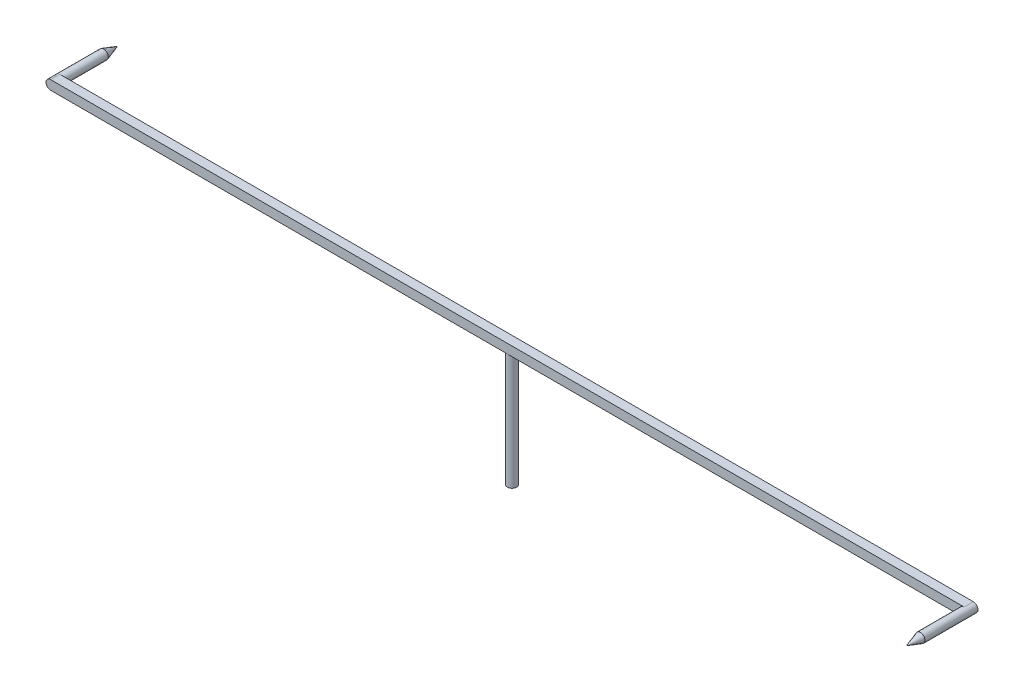
ISO-10303-21;
HEADER;
FILE_DESCRIPTION(('STEP AP214'),'2;1');
FILE_NAME('part.step','',(''),(''),'','','');
FILE_SCHEMA(('AUTOMOTIVE_DESIGN { 1 0 10303 214 1 1 1 1 }'));
ENDSEC;
DATA;
#1=APPLICATION_CONTEXT('core data for automotive mechanical design processes');
#2=APPLICATION_PROTOCOL_DEFINITION('international standard','automotive_design',2000,#1);
#3=PRODUCT_CONTEXT('',#1,'mechanical');
#4=PRODUCT('Part','Part','',(#3));
#5=PRODUCT_RELATED_PRODUCT_CATEGORY('part','',(#4));
#6=PRODUCT_DEFINITION_FORMATION('','',#4);
#7=PRODUCT_DEFINITION_CONTEXT('part definition',#1,'design');
#8=PRODUCT_DEFINITION('design','',#6,#7);
#9=PRODUCT_DEFINITION_SHAPE('','',#8);
#10=(LENGTH_UNIT() NAMED_UNIT(*) SI_UNIT(.MILLI.,.METRE.));
#11=(NAMED_UNIT(*) PLANE_ANGLE_UNIT() SI_UNIT($,.RADIAN.));
#12=(NAMED_UNIT(*) SI_UNIT($,.STERADIAN.) SOLID_ANGLE_UNIT());
#13=UNCERTAINTY_MEASURE_WITH_UNIT(LENGTH_MEASURE(1.E-05),#10,'distance_accuracy_value','');
#14=(GEOMETRIC_REPRESENTATION_CONTEXT(3) GLOBAL_UNCERTAINTY_ASSIGNED_CONTEXT((#13)) GLOBAL_UNIT_ASSIGNED_CONTEXT((#10,
#11,#12)) REPRESENTATION_CONTEXT('',''));
#15=CARTESIAN_POINT('',(0.,0.,0.));
#16=DIRECTION('',(0.,0.,1.));
#17=DIRECTION('',(1.,0.,0.));
#18=AXIS2_PLACEMENT_3D('',#15,#16,#17);
#19=CARTESIAN_POINT('',(0.,10.,0.));
#20=DIRECTION('',(0.,-1.,0.));
#21=DIRECTION('',(0.,0.,-1.));
#22=AXIS2_PLACEMENT_3D('',#19,#20,#21);
#23=CYLINDRICAL_SURFACE('',#22,0.4);
#24=CARTESIAN_POINT('',(0.,10.,0.));
#25=DIRECTION('',(0.,1.,0.));
#26=DIRECTION('',(0.,0.,1.));
#27=AXIS2_PLACEMENT_3D('',#24,#25,#26);
#28=CIRCLE('',#27,0.4);
#29=CARTESIAN_POINT('',(0.,10.,0.4));
#30=VERTEX_POINT('',#29);
#31=CARTESIAN_POINT('',(0.,10.,-0.4));
#32=VERTEX_POINT('',#31);
#33=EDGE_CURVE('E164',#30,#32,#28,.T.);
#34=ORIENTED_EDGE('',*,*,#33,.F.);
#35=EDGE_CURVE('E168',#32,#30,#28,.T.);
#36=ORIENTED_EDGE('',*,*,#35,.F.);
#37=EDGE_LOOP('',(#34,#36));
#38=FACE_BOUND('',#37,.T.);
#39=CARTESIAN_POINT('',(0.,0.,0.));
#40=DIRECTION('',(0.,1.,0.));
#41=DIRECTION('',(0.,0.,1.));
#42=AXIS2_PLACEMENT_3D('',#39,#40,#41);
#43=CIRCLE('',#42,0.4);
#44=CARTESIAN_POINT('',(0.,0.,0.4));
#45=VERTEX_POINT('',#44);
#46=EDGE_CURVE('E158',#45,#45,#43,.T.);
#47=ORIENTED_EDGE('',*,*,#46,.T.);
#48=EDGE_LOOP('',(#47));
#49=FACE_BOUND('',#48,.T.);
#50=ADVANCED_FACE('F37',(#38,#49),#23,.T.);
#51=CARTESIAN_POINT('',(0.,0.,0.));
#52=DIRECTION('',(0.,1.,0.));
#53=DIRECTION('',(0.,0.,1.));
#54=AXIS2_PLACEMENT_3D('',#51,#52,#53);
#55=PLANE('',#54);
#56=ORIENTED_EDGE('',*,*,#46,.F.);
#57=EDGE_LOOP('',(#56));
#58=FACE_BOUND('',#57,.T.);
#59=ADVANCED_FACE('F114',(#58),#55,.F.);
#60=CARTESIAN_POINT('',(0.,10.,0.));
#61=DIRECTION('',(0.,1.,0.));
#62=DIRECTION('',(0.,0.,1.));
#63=AXIS2_PLACEMENT_3D('',#60,#61,#62);
#64=PLANE('',#63);
#65=DIRECTION('',(-1.,0.,0.));
#66=VECTOR('',#65,1.);
#67=CARTESIAN_POINT('',(-40.,10.,-0.4));
#68=LINE('',#67,#66);
#69=CARTESIAN_POINT('',(39.6,10.,-0.4));
#70=VERTEX_POINT('',#69);
#71=EDGE_CURVE('E156',#70,#32,#68,.T.);
#72=ORIENTED_EDGE('',*,*,#71,.F.);
#73=DIRECTION('',(0.,0.,-1.));
#74=VECTOR('',#73,1.);
#75=CARTESIAN_POINT('',(39.6,10.,0.));
#76=LINE('',#75,#74);
#77=CARTESIAN_POINT('',(39.6,10.,0.4));
#78=VERTEX_POINT('',#77);
#79=EDGE_CURVE('E11',#70,#78,#76,.F.);
#80=ORIENTED_EDGE('',*,*,#79,.T.);
#81=DIRECTION('',(1.,0.,0.));
#82=VECTOR('',#81,1.);
#83=CARTESIAN_POINT('',(-40.,10.,0.4));
#84=LINE('',#83,#82);
#85=EDGE_CURVE('E162',#30,#78,#84,.T.);
#86=ORIENTED_EDGE('',*,*,#85,.F.);
#87=ORIENTED_EDGE('',*,*,#33,.T.);
#88=EDGE_LOOP('',(#72,#80,#86,#87));
#89=FACE_BOUND('',#88,.T.);
#90=ADVANCED_FACE('F120',(#89),#64,.F.);
#91=CARTESIAN_POINT('',(-39.6,10.,0.4));
#92=VERTEX_POINT('',#91);
#93=EDGE_CURVE('E159',#92,#30,#84,.T.);
#94=ORIENTED_EDGE('',*,*,#93,.F.);
#95=DIRECTION('',(0.,0.,1.));
#96=VECTOR('',#95,1.);
#97=CARTESIAN_POINT('',(-39.6,10.,0.));
#98=LINE('',#97,#96);
#99=CARTESIAN_POINT('',(-39.6,10.,-0.4));
#100=VERTEX_POINT('',#99);
#101=EDGE_CURVE('E174',#92,#100,#98,.F.);
#102=ORIENTED_EDGE('',*,*,#101,.T.);
#103=EDGE_CURVE('E161',#32,#100,#68,.T.);
#104=ORIENTED_EDGE('',*,*,#103,.F.);
#105=ORIENTED_EDGE('',*,*,#35,.T.);
#106=EDGE_LOOP('',(#94,#102,#104,#105));
#107=FACE_BOUND('',#106,.T.);
#108=ADVANCED_FACE('F197',(#107),#64,.F.);
#109=CARTESIAN_POINT('',(-40.,10.8,0.4));
#110=DIRECTION('',(0.,0.,-1.));
#111=DIRECTION('',(-1.,0.,0.));
#112=AXIS2_PLACEMENT_3D('',#109,#110,#111);
#113=PLANE('',#112);
#114=CARTESIAN_POINT('',(39.6,10.4,0.4));
#115=DIRECTION('',(0.,0.,1.));
#116=DIRECTION('',(1.,0.,0.));
#117=AXIS2_PLACEMENT_3D('',#114,#115,#116);
#118=CIRCLE('',#117,0.399999999999998);
#119=CARTESIAN_POINT('',(39.6,10.8,0.4));
#120=VERTEX_POINT('',#119);
#121=EDGE_CURVE('E143',#120,#78,#118,.T.);
#122=ORIENTED_EDGE('',*,*,#121,.F.);
#123=DIRECTION('',(1.,0.,0.));
#124=VECTOR('',#123,1.);
#125=CARTESIAN_POINT('',(-40.,10.8,0.4));
#126=LINE('',#125,#124);
#127=CARTESIAN_POINT('',(-39.6,10.8,0.4));
#128=VERTEX_POINT('',#127);
#129=EDGE_CURVE('E152',#128,#120,#126,.T.);
#130=ORIENTED_EDGE('',*,*,#129,.F.);
#131=CARTESIAN_POINT('',(-39.6,10.4,0.4));
#132=DIRECTION('',(0.,0.,-1.));
#133=DIRECTION('',(-1.,0.,0.));
#134=AXIS2_PLACEMENT_3D('',#131,#132,#133);
#135=CIRCLE('',#134,0.4);
#136=CARTESIAN_POINT('',(-40.,10.4,0.4));
#137=VERTEX_POINT('',#136);
#138=EDGE_CURVE('E167',#128,#137,#135,.F.);
#139=ORIENTED_EDGE('',*,*,#138,.T.);
#140=CARTESIAN_POINT('',(-39.6,10.4,0.4));
#141=DIRECTION('',(0.,0.,-1.));
#142=DIRECTION('',(-1.,0.,0.));
#143=AXIS2_PLACEMENT_3D('',#140,#141,#142);
#144=CIRCLE('',#143,0.4);
#145=EDGE_CURVE('E172',#137,#92,#144,.F.);
#146=ORIENTED_EDGE('',*,*,#145,.T.);
#147=ORIENTED_EDGE('',*,*,#93,.T.);
#148=ORIENTED_EDGE('',*,*,#85,.T.);
#149=EDGE_LOOP('',(#122,#130,#139,#146,#147,#148));
#150=FACE_BOUND('',#149,.T.);
#151=ADVANCED_FACE('F200',(#150),#113,.F.);
#152=CARTESIAN_POINT('',(-40.,10.8,-0.4));
#153=DIRECTION('',(0.,0.,1.));
#154=DIRECTION('',(1.,0.,0.));
#155=AXIS2_PLACEMENT_3D('',#152,#153,#154);
#156=PLANE('',#155);
#157=CARTESIAN_POINT('',(-39.6,10.4,-0.4));
#158=DIRECTION('',(0.,0.,-1.));
#159=DIRECTION('',(-1.,0.,0.));
#160=AXIS2_PLACEMENT_3D('',#157,#158,#159);
#161=CIRCLE('',#160,0.399999999999998);
#162=CARTESIAN_POINT('',(-39.6,10.8,-0.4));
#163=VERTEX_POINT('',#162);
#164=EDGE_CURVE('E60',#163,#100,#161,.T.);
#165=ORIENTED_EDGE('',*,*,#164,.F.);
#166=DIRECTION('',(-1.,0.,0.));
#167=VECTOR('',#166,1.);
#168=CARTESIAN_POINT('',(-40.,10.8,-0.4));
#169=LINE('',#168,#167);
#170=CARTESIAN_POINT('',(39.6,10.8,-0.4));
#171=VERTEX_POINT('',#170);
#172=EDGE_CURVE('E155',#171,#163,#169,.T.);
#173=ORIENTED_EDGE('',*,*,#172,.F.);
#174=CARTESIAN_POINT('',(39.6,10.4,-0.4));
#175=DIRECTION('',(0.,0.,1.));
#176=DIRECTION('',(1.,0.,0.));
#177=AXIS2_PLACEMENT_3D('',#174,#175,#176);
#178=CIRCLE('',#177,0.4);
#179=CARTESIAN_POINT('',(40.,10.4,-0.4));
#180=VERTEX_POINT('',#179);
#181=EDGE_CURVE('E54',#171,#180,#178,.F.);
#182=ORIENTED_EDGE('',*,*,#181,.T.);
#183=CARTESIAN_POINT('',(39.6,10.4,-0.4));
#184=DIRECTION('',(0.,0.,1.));
#185=DIRECTION('',(1.,0.,0.));
#186=AXIS2_PLACEMENT_3D('',#183,#184,#185);
#187=CIRCLE('',#186,0.4);
#188=EDGE_CURVE('E177',#180,#70,#187,.F.);
#189=ORIENTED_EDGE('',*,*,#188,.T.);
#190=ORIENTED_EDGE('',*,*,#71,.T.);
#191=ORIENTED_EDGE('',*,*,#103,.T.);
#192=EDGE_LOOP('',(#165,#173,#182,#189,#190,#191));
#193=FACE_BOUND('',#192,.T.);
#194=ADVANCED_FACE('F135',(#193),#156,.F.);
#195=CARTESIAN_POINT('',(0.,10.8,0.));
#196=DIRECTION('',(0.,1.,0.));
#197=DIRECTION('',(0.,0.,1.));
#198=AXIS2_PLACEMENT_3D('',#195,#196,#197);
#199=PLANE('',#198);
#200=ORIENTED_EDGE('',*,*,#172,.T.);
#201=DIRECTION('',(0.,0.,1.));
#202=VECTOR('',#201,1.);
#203=CARTESIAN_POINT('',(-39.6,10.8,0.4));
#204=LINE('',#203,#202);
#205=EDGE_CURVE('E46',#163,#128,#204,.T.);
#206=ORIENTED_EDGE('',*,*,#205,.T.);
#207=ORIENTED_EDGE('',*,*,#129,.T.);
#208=DIRECTION('',(0.,0.,-1.));
#209=VECTOR('',#208,1.);
#210=CARTESIAN_POINT('',(39.6,10.8,-0.4));
#211=LINE('',#210,#209);
#212=EDGE_CURVE('E179',#120,#171,#211,.T.);
#213=ORIENTED_EDGE('',*,*,#212,.T.);
#214=EDGE_LOOP('',(#200,#206,#207,#213));
#215=FACE_BOUND('',#214,.T.);
#216=ADVANCED_FACE('F128',(#215),#199,.T.);
#217=CARTESIAN_POINT('',(-39.6,10.4,0.));
#218=DIRECTION('',(0.,0.,-1.));
#219=DIRECTION('',(-1.,0.,0.));
#220=AXIS2_PLACEMENT_3D('',#217,#218,#219);
#221=CYLINDRICAL_SURFACE('',#220,0.4);
#222=ORIENTED_EDGE('',*,*,#205,.F.);
#223=ORIENTED_EDGE('',*,*,#164,.T.);
#224=ORIENTED_EDGE('',*,*,#101,.F.);
#225=ORIENTED_EDGE('',*,*,#145,.F.);
#226=DIRECTION('',(0.,0.,1.));
#227=VECTOR('',#226,1.);
#228=CARTESIAN_POINT('',(-40.,10.4,-0.4));
#229=LINE('',#228,#227);
#230=CARTESIAN_POINT('',(-40.,10.4,-0.4));
#231=VERTEX_POINT('',#230);
#232=EDGE_CURVE('E181',#137,#231,#229,.F.);
#233=ORIENTED_EDGE('',*,*,#232,.T.);
#234=ORIENTED_EDGE('',*,*,#232,.F.);
#235=ORIENTED_EDGE('',*,*,#138,.F.);
#236=EDGE_LOOP('',(#222,#223,#224,#225,#233,#234,#235));
#237=FACE_BOUND('',#236,.T.);
#238=CARTESIAN_POINT('',(-39.6,10.4,-4.2));
#239=DIRECTION('',(0.,0.,-1.));
#240=DIRECTION('',(-1.,0.,0.));
#241=AXIS2_PLACEMENT_3D('',#238,#239,#240);
#242=CIRCLE('',#241,0.399999999999998);
#243=CARTESIAN_POINT('',(-40.,10.4,-4.2));
#244=VERTEX_POINT('',#243);
#245=EDGE_CURVE('E142',#244,#244,#242,.T.);
#246=ORIENTED_EDGE('',*,*,#245,.F.);
#247=EDGE_LOOP('',(#246));
#248=FACE_BOUND('',#247,.T.);
#249=ADVANCED_FACE('F126',(#237,#248),#221,.T.);
#250=CARTESIAN_POINT('',(39.6,10.4,0.));
#251=DIRECTION('',(0.,0.,1.));
#252=DIRECTION('',(1.,0.,0.));
#253=AXIS2_PLACEMENT_3D('',#250,#251,#252);
#254=CYLINDRICAL_SURFACE('',#253,0.4);
#255=ORIENTED_EDGE('',*,*,#212,.F.);
#256=ORIENTED_EDGE('',*,*,#121,.T.);
#257=ORIENTED_EDGE('',*,*,#79,.F.);
#258=ORIENTED_EDGE('',*,*,#188,.F.);
#259=DIRECTION('',(0.,0.,-1.));
#260=VECTOR('',#259,1.);
#261=CARTESIAN_POINT('',(40.,10.4,0.4));
#262=LINE('',#261,#260);
#263=CARTESIAN_POINT('',(40.,10.4,0.4));
#264=VERTEX_POINT('',#263);
#265=EDGE_CURVE('E41',#180,#264,#262,.F.);
#266=ORIENTED_EDGE('',*,*,#265,.T.);
#267=ORIENTED_EDGE('',*,*,#265,.F.);
#268=ORIENTED_EDGE('',*,*,#181,.F.);
#269=EDGE_LOOP('',(#255,#256,#257,#258,#266,#267,#268));
#270=FACE_BOUND('',#269,.T.);
#271=CARTESIAN_POINT('',(39.6,10.4,4.2));
#272=DIRECTION('',(0.,0.,1.));
#273=DIRECTION('',(1.,0.,0.));
#274=AXIS2_PLACEMENT_3D('',#271,#272,#273);
#275=CIRCLE('',#274,0.399999999999998);
#276=CARTESIAN_POINT('',(40.,10.4,4.2));
#277=VERTEX_POINT('',#276);
#278=EDGE_CURVE('E146',#277,#277,#275,.T.);
#279=ORIENTED_EDGE('',*,*,#278,.F.);
#280=EDGE_LOOP('',(#279));
#281=FACE_BOUND('',#280,.T.);
#282=ADVANCED_FACE('F39',(#270,#281),#254,.T.);
#283=CARTESIAN_POINT('',(39.6,10.4,5.4));
#284=DIRECTION('',(0.,0.,-1.));
#285=DIRECTION('',(-1.,0.,0.));
#286=AXIS2_PLACEMENT_3D('',#283,#284,#285);
#287=CONICAL_SURFACE('',#286,0.,0.32175055439664);
#288=ORIENTED_EDGE('',*,*,#278,.T.);
#289=EDGE_LOOP('',(#288));
#290=FACE_BOUND('',#289,.T.);
#291=CARTESIAN_POINT('',(39.6,10.4,5.4));
#292=VERTEX_POINT('',#291);
#293=VERTEX_LOOP('',#292);
#294=FACE_BOUND('',#293,.T.);
#295=ADVANCED_FACE('F104',(#290,#294),#287,.T.);
#296=CARTESIAN_POINT('',(-39.6,10.4,-5.4));
#297=DIRECTION('',(0.,0.,1.));
#298=DIRECTION('',(1.,0.,0.));
#299=AXIS2_PLACEMENT_3D('',#296,#297,#298);
#300=CONICAL_SURFACE('',#299,0.,0.32175055439664);
#301=ORIENTED_EDGE('',*,*,#245,.T.);
#302=EDGE_LOOP('',(#301));
#303=FACE_BOUND('',#302,.T.);
#304=CARTESIAN_POINT('',(-39.6,10.4,-5.4));
#305=VERTEX_POINT('',#304);
#306=VERTEX_LOOP('',#305);
#307=FACE_BOUND('',#306,.T.);
#308=ADVANCED_FACE('F102',(#303,#307),#300,.T.);
#309=CLOSED_SHELL('',(#50,#59,#90,#108,#151,#194,#216,#249,#282,#295,#308));
#310=MANIFOLD_SOLID_BREP('B2',#309);
#311=ADVANCED_BREP_SHAPE_REPRESENTATION('',(#18,#310),#14);
#312=SHAPE_DEFINITION_REPRESENTATION(#9,#311);
ENDSEC;
END-ISO-10303-21;
